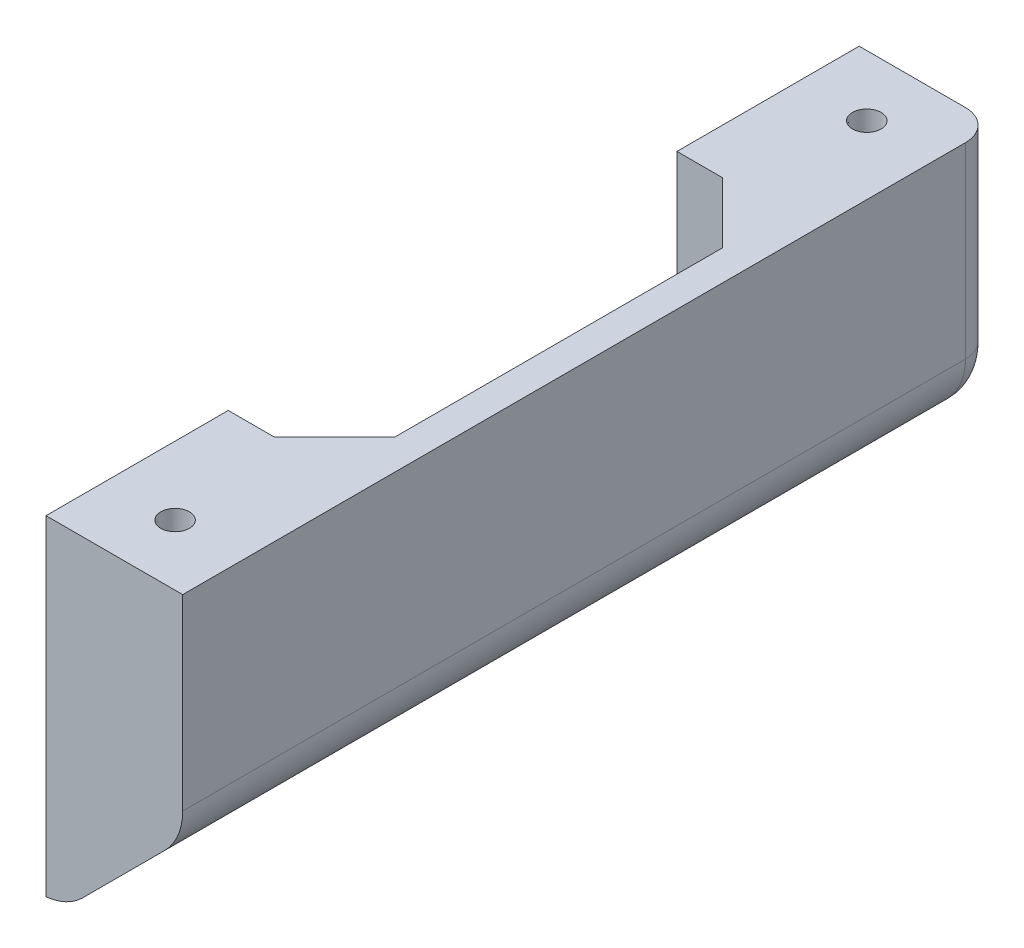
ISO-10303-21;
HEADER;
FILE_DESCRIPTION(('STEP AP214'),'2;1');
FILE_NAME('part.step','',(''),(''),'','','');
FILE_SCHEMA(('AUTOMOTIVE_DESIGN { 1 0 10303 214 1 1 1 1 }'));
ENDSEC;
DATA;
#1=APPLICATION_CONTEXT('core data for automotive mechanical design processes');
#2=APPLICATION_PROTOCOL_DEFINITION('international standard','automotive_design',2000,#1);
#3=PRODUCT_CONTEXT('',#1,'mechanical');
#4=PRODUCT('Part','Part','',(#3));
#5=PRODUCT_RELATED_PRODUCT_CATEGORY('part','',(#4));
#6=PRODUCT_DEFINITION_FORMATION('','',#4);
#7=PRODUCT_DEFINITION_CONTEXT('part definition',#1,'design');
#8=PRODUCT_DEFINITION('design','',#6,#7);
#9=PRODUCT_DEFINITION_SHAPE('','',#8);
#10=(LENGTH_UNIT() NAMED_UNIT(*) SI_UNIT(.MILLI.,.METRE.));
#11=(NAMED_UNIT(*) PLANE_ANGLE_UNIT() SI_UNIT($,.RADIAN.));
#12=(NAMED_UNIT(*) SI_UNIT($,.STERADIAN.) SOLID_ANGLE_UNIT());
#13=UNCERTAINTY_MEASURE_WITH_UNIT(LENGTH_MEASURE(1.E-05),#10,'distance_accuracy_value','');
#14=(GEOMETRIC_REPRESENTATION_CONTEXT(3) GLOBAL_UNCERTAINTY_ASSIGNED_CONTEXT((#13)) GLOBAL_UNIT_ASSIGNED_CONTEXT((#10,
#11,#12)) REPRESENTATION_CONTEXT('',''));
#15=CARTESIAN_POINT('',(0.,0.,0.));
#16=DIRECTION('',(0.,0.,1.));
#17=DIRECTION('',(1.,0.,0.));
#18=AXIS2_PLACEMENT_3D('',#15,#16,#17);
#19=CARTESIAN_POINT('',(-231.304465963193,69.0000000000106,-244.682867011126));
#20=DIRECTION('',(0.,-1.00000000000003,0.));
#21=DIRECTION('',(0.,0.,1.00000000000003));
#22=AXIS2_PLACEMENT_3D('',#19,#20,#21);
#23=PLANE('',#22);
#24=CARTESIAN_POINT('',(-217.016965963193,69.0000000000068,-12.700000000001));
#25=DIRECTION('',(0.,-1.00000000000003,0.));
#26=DIRECTION('',(0.,0.,-1.00000000000003));
#27=AXIS2_PLACEMENT_3D('',#24,#25,#26);
#28=CIRCLE('',#27,2.99720000000001);
#29=CARTESIAN_POINT('',(-217.016965963193,69.0000000000068,-15.6972000000011));
#30=VERTEX_POINT('',#29);
#31=EDGE_CURVE('E204',#30,#30,#28,.T.);
#32=ORIENTED_EDGE('',*,*,#31,.T.);
#33=EDGE_LOOP('',(#32));
#34=FACE_BOUND('',#33,.T.);
#35=CARTESIAN_POINT('',(-217.016965963193,69.0000000000091,-157.300000000006));
#36=DIRECTION('',(0.,-1.00000000000003,0.));
#37=DIRECTION('',(0.,0.,-1.00000000000003));
#38=AXIS2_PLACEMENT_3D('',#35,#36,#37);
#39=CIRCLE('',#38,2.99720000000001);
#40=CARTESIAN_POINT('',(-217.016965963193,69.0000000000092,-160.297200000006));
#41=VERTEX_POINT('',#40);
#42=EDGE_CURVE('E210',#41,#41,#39,.T.);
#43=ORIENTED_EDGE('',*,*,#42,.T.);
#44=EDGE_LOOP('',(#43));
#45=FACE_BOUND('',#44,.T.);
#46=DIRECTION('',(0.,0.,1.00000000000003));
#47=VECTOR('',#46,1.);
#48=CARTESIAN_POINT('',(-209.079465963193,69.0000000000119,-244.682867011126));
#49=LINE('',#48,#47);
#50=CARTESIAN_POINT('',(-209.079465963193,69.0000000000098,-119.200000000005));
#51=VERTEX_POINT('',#50);
#52=CARTESIAN_POINT('',(-209.079465963193,69.0000000000086,-50.8000000000031));
#53=VERTEX_POINT('',#52);
#54=EDGE_CURVE('E238',#51,#53,#49,.T.);
#55=ORIENTED_EDGE('',*,*,#54,.T.);
#56=DIRECTION('',(-0.707106781186556,0.,0.707106781186573));
#57=VECTOR('',#56,1.);
#58=CARTESIAN_POINT('',(-123.250532457636,69.0000000000074,-136.628933505565));
#59=LINE('',#58,#57);
#60=CARTESIAN_POINT('',(-221.779465963193,69.0000000000079,-38.1000000000018));
#61=VERTEX_POINT('',#60);
#62=EDGE_CURVE('E11',#61,#53,#59,.F.);
#63=ORIENTED_EDGE('',*,*,#62,.F.);
#64=DIRECTION('',(-1.,0.,0.));
#65=VECTOR('',#64,1.);
#66=CARTESIAN_POINT('',(-202.727465963193,69.0000000000051,-38.1000000000016));
#67=LINE('',#66,#65);
#68=CARTESIAN_POINT('',(-231.304465963193,69.000000000008,-38.1000000000019));
#69=VERTEX_POINT('',#68);
#70=EDGE_CURVE('E222',#61,#69,#67,.T.);
#71=ORIENTED_EDGE('',*,*,#70,.T.);
#72=DIRECTION('',(0.,0.,1.00000000000003));
#73=VECTOR('',#72,1.);
#74=CARTESIAN_POINT('',(-231.304465963193,69.0000000000106,-244.682867011126));
#75=LINE('',#74,#73);
#76=CARTESIAN_POINT('',(-231.304465963193,69.0000000000077,-9.15933995315754E-13));
#77=VERTEX_POINT('',#76);
#78=EDGE_CURVE('E256',#69,#77,#75,.T.);
#79=ORIENTED_EDGE('',*,*,#78,.T.);
#80=DIRECTION('',(-1.,0.,0.));
#81=VECTOR('',#80,1.);
#82=CARTESIAN_POINT('',(-231.304465963193,69.0000000000077,-9.15933995315754E-13));
#83=LINE('',#82,#81);
#84=CARTESIAN_POINT('',(-202.729465963193,69.0000000000044,-4.44089209850063E-13));
#85=VERTEX_POINT('',#84);
#86=EDGE_CURVE('E253',#85,#77,#83,.T.);
#87=ORIENTED_EDGE('',*,*,#86,.F.);
#88=DIRECTION('',(0.,0.,1.00000000000003));
#89=VECTOR('',#88,1.);
#90=CARTESIAN_POINT('',(-202.729465963193,69.0000000000086,-244.682867011126));
#91=LINE('',#90,#89);
#92=CARTESIAN_POINT('',(-202.729465963193,69.0000000000079,-163.650000000006));
#93=VERTEX_POINT('',#92);
#94=EDGE_CURVE('E235',#93,#85,#91,.T.);
#95=ORIENTED_EDGE('',*,*,#94,.F.);
#96=CARTESIAN_POINT('',(-209.079465963193,69.0000000000106,-163.650000000006));
#97=DIRECTION('',(0.,1.00000000000003,0.));
#98=DIRECTION('',(0.,0.,1.00000000000003));
#99=AXIS2_PLACEMENT_3D('',#96,#97,#98);
#100=CIRCLE('',#99,6.35);
#101=CARTESIAN_POINT('',(-209.079465963193,69.0000000000106,-170.000000000007));
#102=VERTEX_POINT('',#101);
#103=EDGE_CURVE('E292',#102,#93,#100,.F.);
#104=ORIENTED_EDGE('',*,*,#103,.F.);
#105=DIRECTION('',(-1.,0.,0.));
#106=VECTOR('',#105,1.);
#107=CARTESIAN_POINT('',(-231.304465963193,69.0000000000096,-170.000000000007));
#108=LINE('',#107,#106);
#109=CARTESIAN_POINT('',(-231.304465963193,69.0000000000096,-170.000000000007));
#110=VERTEX_POINT('',#109);
#111=EDGE_CURVE('E244',#102,#110,#108,.T.);
#112=ORIENTED_EDGE('',*,*,#111,.T.);
#113=CARTESIAN_POINT('',(-231.304465963193,69.0000000000092,-131.900000000005));
#114=VERTEX_POINT('',#113);
#115=EDGE_CURVE('E252',#110,#114,#75,.T.);
#116=ORIENTED_EDGE('',*,*,#115,.T.);
#117=DIRECTION('',(-1.,0.,0.));
#118=VECTOR('',#117,1.);
#119=CARTESIAN_POINT('',(-202.727465963193,69.0000000000073,-131.900000000005));
#120=LINE('',#119,#118);
#121=CARTESIAN_POINT('',(-221.779465963193,69.0000000000089,-131.900000000005));
#122=VERTEX_POINT('',#121);
#123=EDGE_CURVE('E219',#122,#114,#120,.T.);
#124=ORIENTED_EDGE('',*,*,#123,.F.);
#125=DIRECTION('',(0.707106781186532,0.,0.707106781186574));
#126=VECTOR('',#125,1.);
#127=CARTESIAN_POINT('',(-282.933399468757,69.0000000000099,-193.053933505566));
#128=LINE('',#127,#126);
#129=EDGE_CURVE('E426',#51,#122,#128,.F.);
#130=ORIENTED_EDGE('',*,*,#129,.F.);
#131=EDGE_LOOP('',(#55,#63,#71,#79,#87,#95,#104,#112,#116,#124,#130));
#132=FACE_BOUND('',#131,.T.);
#133=ADVANCED_FACE('F37',(#34,#45,#132),#23,.F.);
#134=CARTESIAN_POINT('',(-231.304465963193,5.93969318174459E-12,-244.682867011125));
#135=DIRECTION('',(1.,0.,0.));
#136=DIRECTION('',(0.,0.,1.00000000000003));
#137=AXIS2_PLACEMENT_3D('',#134,#135,#136);
#138=PLANE('',#137);
#139=CARTESIAN_POINT('',(-231.304465963193,34.5000000000071,-141.425000000005));
#140=DIRECTION('',(1.,0.,0.));
#141=DIRECTION('',(0.,0.,-1.00000000000003));
#142=AXIS2_PLACEMENT_3D('',#139,#140,#141);
#143=CIRCLE('',#142,2.99720000000001);
#144=CARTESIAN_POINT('',(-231.304465963193,34.5000000000071,-144.422200000005));
#145=VERTEX_POINT('',#144);
#146=EDGE_CURVE('E184',#145,#145,#143,.T.);
#147=ORIENTED_EDGE('',*,*,#146,.T.);
#148=EDGE_LOOP('',(#147));
#149=FACE_BOUND('',#148,.T.);
#150=CARTESIAN_POINT('',(-231.304465963193,34.5000000000057,-19.0500000000011));
#151=DIRECTION('',(1.,0.,0.));
#152=DIRECTION('',(0.,0.,-1.00000000000003));
#153=AXIS2_PLACEMENT_3D('',#150,#151,#152);
#154=CIRCLE('',#153,2.99720000000001);
#155=CARTESIAN_POINT('',(-231.304465963193,34.5000000000057,-22.0472000000012));
#156=VERTEX_POINT('',#155);
#157=EDGE_CURVE('E190',#156,#156,#154,.T.);
#158=ORIENTED_EDGE('',*,*,#157,.T.);
#159=EDGE_LOOP('',(#158));
#160=FACE_BOUND('',#159,.T.);
#161=DIRECTION('',(0.,-1.00000000000003,0.));
#162=VECTOR('',#161,1.);
#163=CARTESIAN_POINT('',(-231.304465963193,69.0000000000092,-131.900000000005));
#164=LINE('',#163,#162);
#165=CARTESIAN_POINT('',(-231.30446596319,22.9157683632159,-131.900000000005));
#166=VERTEX_POINT('',#165);
#167=EDGE_CURVE('E216',#114,#166,#164,.T.);
#168=ORIENTED_EDGE('',*,*,#167,.F.);
#169=ORIENTED_EDGE('',*,*,#115,.F.);
#170=DIRECTION('',(0.,-1.00000000000003,0.));
#171=VECTOR('',#170,1.);
#172=CARTESIAN_POINT('',(-231.304465963193,4.21884749357559E-12,-170.000000000006));
#173=LINE('',#172,#171);
#174=CARTESIAN_POINT('',(-231.304465963193,6.41804812750946,-170.000000000006));
#175=VERTEX_POINT('',#174);
#176=EDGE_CURVE('E257',#110,#175,#173,.T.);
#177=ORIENTED_EDGE('',*,*,#176,.T.);
#178=CARTESIAN_POINT('',(-231.304465963193,3.83026943495679E-12,-163.650000000005));
#179=CARTESIAN_POINT('',(-231.304465963193,-1.94645687613547E-05,-163.827803696936));
#180=CARTESIAN_POINT('',(-231.304465963193,0.00750667466375468,-164.005604471068));
#181=CARTESIAN_POINT('',(-231.304465963193,0.0375094933302196,-164.359930980728));
#182=CARTESIAN_POINT('',(-231.304465963193,0.0599853722506052,-164.536456784015));
#183=CARTESIAN_POINT('',(-231.304465963193,0.119721245660342,-164.88683222851));
#184=CARTESIAN_POINT('',(-231.304465963193,0.156968465720615,-165.060684047614));
#185=CARTESIAN_POINT('',(-231.304465963193,0.245971625268004,-165.404630889584));
#186=CARTESIAN_POINT('',(-231.304465963193,0.297727401623886,-165.574725954666));
#187=CARTESIAN_POINT('',(-231.304465963193,0.415391932519223,-165.91000029629));
#188=CARTESIAN_POINT('',(-231.304465963193,0.481304540643922,-166.075178220386));
#189=CARTESIAN_POINT('',(-231.304465963193,0.626825096149477,-166.399459779303));
#190=CARTESIAN_POINT('',(-231.304465963193,0.706438076862064,-166.558561155339));
#191=CARTESIAN_POINT('',(-231.304465963193,0.878739451237914,-166.869448719973));
#192=CARTESIAN_POINT('',(-231.304465963193,0.971423457833145,-167.021237340134));
#193=CARTESIAN_POINT('',(-231.304465963193,1.16922184311304,-167.316491773836));
#194=CARTESIAN_POINT('',(-231.304465963193,1.27433652145266,-167.459957386617));
#195=CARTESIAN_POINT('',(-231.304465963193,1.49639703834618,-167.737755205205));
#196=CARTESIAN_POINT('',(-231.304465963193,1.61335952649071,-167.872074101574));
#197=CARTESIAN_POINT('',(-231.304465963193,1.85814907794117,-168.130416736264));
#198=CARTESIAN_POINT('',(-231.304465963193,1.9859761587785,-168.254440457971));
#199=CARTESIAN_POINT('',(-231.304465963193,2.25159440057136,-168.491349975786));
#200=CARTESIAN_POINT('',(-231.304465963193,2.38938684413101,-168.604234333751));
#201=CARTESIAN_POINT('',(-231.304465963193,2.67393253723037,-168.818073507178));
#202=CARTESIAN_POINT('',(-231.304465963193,2.82068567266183,-168.919028474504));
#203=CARTESIAN_POINT('',(-231.304465963193,3.12285855334713,-169.108802472058));
#204=CARTESIAN_POINT('',(-231.304465963193,3.27831774550247,-169.197558695214));
#205=CARTESIAN_POINT('',(-231.304465963193,3.59606019388042,-169.361721397576));
#206=CARTESIAN_POINT('',(-231.304465963193,3.75834108405891,-169.437132458915));
#207=CARTESIAN_POINT('',(-231.304465963193,4.08862458888874,-169.574158612));
#208=CARTESIAN_POINT('',(-231.304465963193,4.25662696478117,-169.635774278619));
#209=CARTESIAN_POINT('',(-231.304465963193,4.59710267553243,-169.74482959152));
#210=CARTESIAN_POINT('',(-231.304465963193,4.76957507653026,-169.792272173255));
#211=CARTESIAN_POINT('',(-231.304465963193,5.18540606109357,-169.888337439605));
#212=CARTESIAN_POINT('',(-231.304465963193,5.43035077199738,-169.930302426444));
#213=CARTESIAN_POINT('',(-231.304465963193,5.79978470030706,-169.972170078544));
#214=CARTESIAN_POINT('',(-231.304465963193,5.92318413235425,-169.982612703535));
#215=CARTESIAN_POINT('',(-231.304465963193,6.1703947621389,-169.996527939177));
#216=CARTESIAN_POINT('',(-231.304465963193,6.29420601995963,-169.999999483698));
#217=CARTESIAN_POINT('',(-231.304465963193,6.41804812750985,-170.000000000006));
#218=B_SPLINE_CURVE_WITH_KNOTS('',3,(#178,#179,#180,#181,#182,#183,#184,#185,#186,#187,#188,
#189,#190,#191,#192,#193,#194,#195,#196,#197,#198,#199,#200,#201,#202,#203,#204,#205,#206,#207,
#208,#209,#210,#211,#212,#213,#214,#215,#216,#217),.UNSPECIFIED.,.F.,.F.,(4,2,2,2,2,2,2,2,2,2,2,
2,2,2,2,2,2,2,2,4),(0.,0.533247724383949,1.06646689725572,1.59922593802575,2.13197898880257,
2.66487724276769,3.19797169595554,3.7308876489854,4.2638164511572,4.79750484490049,
5.33119409983355,5.8649521665535,6.39870343764898,6.93510736260551,7.47132675148192,
8.00752379115188,8.54360969942229,9.28729610396884,9.65865392644396,10.0300685386423),.UNSPECIFIED.);
#219=CARTESIAN_POINT('',(-231.304465963193,3.83026943495679E-12,-163.650000000005));
#220=VERTEX_POINT('',#219);
#221=EDGE_CURVE('E306',#220,#175,#218,.T.);
#222=ORIENTED_EDGE('',*,*,#221,.F.);
#223=DIRECTION('',(0.,0.,1.00000000000003));
#224=VECTOR('',#223,1.);
#225=CARTESIAN_POINT('',(-231.304465963193,5.93969318174459E-12,-244.682867011125));
#226=LINE('',#225,#224);
#227=CARTESIAN_POINT('',(-231.304465963193,1.11022302462516E-13,2.77555756156289E-13));
#228=VERTEX_POINT('',#227);
#229=EDGE_CURVE('E248',#220,#228,#226,.T.);
#230=ORIENTED_EDGE('',*,*,#229,.T.);
#231=DIRECTION('',(0.,-1.00000000000003,0.));
#232=VECTOR('',#231,1.);
#233=CARTESIAN_POINT('',(-231.304465963193,1.11022302462516E-13,2.77555756156289E-13));
#234=LINE('',#233,#232);
#235=EDGE_CURVE('E249',#77,#228,#234,.T.);
#236=ORIENTED_EDGE('',*,*,#235,.F.);
#237=ORIENTED_EDGE('',*,*,#78,.F.);
#238=DIRECTION('',(0.,1.00000000000003,0.));
#239=VECTOR('',#238,1.);
#240=CARTESIAN_POINT('',(-231.304465963193,69.000000000008,-38.1000000000019));
#241=LINE('',#240,#239);
#242=CARTESIAN_POINT('',(-231.304465963193,22.9157683632144,-38.1000000000008));
#243=VERTEX_POINT('',#242);
#244=EDGE_CURVE('E223',#243,#69,#241,.T.);
#245=ORIENTED_EDGE('',*,*,#244,.F.);
#246=DIRECTION('',(0.,-0.816496580927745,-0.577350269189631));
#247=VECTOR('',#246,1.);
#248=CARTESIAN_POINT('',(-231.304465963193,-89.7455079726098,-117.763552474192));
#249=LINE('',#248,#247);
#250=CARTESIAN_POINT('',(-231.304465963193,6.35000000000335,-49.8137671451923));
#251=VERTEX_POINT('',#250);
#252=EDGE_CURVE('E46',#251,#243,#249,.F.);
#253=ORIENTED_EDGE('',*,*,#252,.F.);
#254=DIRECTION('',(0.,0.,1.00000000000003));
#255=VECTOR('',#254,1.);
#256=CARTESIAN_POINT('',(-231.304465963193,6.3500000000058,-244.682867011125));
#257=LINE('',#256,#255);
#258=CARTESIAN_POINT('',(-231.304465963193,6.35000000000313,-120.186232854814));
#259=VERTEX_POINT('',#258);
#260=EDGE_CURVE('E232',#259,#251,#257,.T.);
#261=ORIENTED_EDGE('',*,*,#260,.F.);
#262=DIRECTION('',(0.,0.816496580927757,-0.577350269189659));
#263=VECTOR('',#262,1.);
#264=CARTESIAN_POINT('',(-231.304465963193,60.8049428312248,-158.691692199896));
#265=LINE('',#264,#263);
#266=EDGE_CURVE('E423',#166,#259,#265,.F.);
#267=ORIENTED_EDGE('',*,*,#266,.F.);
#268=EDGE_LOOP('',(#168,#169,#177,#222,#230,#236,#237,#245,#253,#261,#267));
#269=FACE_BOUND('',#268,.T.);
#270=ADVANCED_FACE('F317',(#149,#160,#269),#138,.F.);
#271=CARTESIAN_POINT('',(-202.729465963193,24.55000000001,-244.682867011125));
#272=DIRECTION('',(-0.707106781186537,0.707106781186568,0.));
#273=DIRECTION('',(-0.707106781186558,-0.707106781186577,0.));
#274=AXIS2_PLACEMENT_3D('',#271,#272,#273);
#275=PLANE('',#274);
#276=DIRECTION('',(0.,0.,1.00000000000003));
#277=VECTOR('',#276,1.);
#278=CARTESIAN_POINT('',(-206.449209842124,20.8302561210795,-244.682867011125));
#279=LINE('',#278,#277);
#280=CARTESIAN_POINT('',(-206.449209842124,20.8302561210761,-2.22044604925031E-13));
#281=VERTEX_POINT('',#280);
#282=CARTESIAN_POINT('',(-206.449209842123,20.8302561210787,-163.650000000005));
#283=VERTEX_POINT('',#282);
#284=EDGE_CURVE('E278',#281,#283,#279,.F.);
#285=ORIENTED_EDGE('',*,*,#284,.F.);
#286=DIRECTION('',(0.707106781186558,0.707106781186577,0.));
#287=VECTOR('',#286,1.);
#288=CARTESIAN_POINT('',(-202.729465963193,24.5500000000037,-1.11022302462516E-13));
#289=LINE('',#288,#287);
#290=CARTESIAN_POINT('',(-223.626687979078,3.65277798412117,-4.44089209850063E-13));
#291=VERTEX_POINT('',#290);
#292=EDGE_CURVE('E245',#291,#281,#289,.T.);
#293=ORIENTED_EDGE('',*,*,#292,.F.);
#294=DIRECTION('',(0.,0.,1.00000000000003));
#295=VECTOR('',#294,1.);
#296=CARTESIAN_POINT('',(-223.626687979079,3.65277798412184,-244.682867011125));
#297=LINE('',#296,#295);
#298=CARTESIAN_POINT('',(-223.626687979078,3.65277798412206,-163.650000000005));
#299=VERTEX_POINT('',#298);
#300=EDGE_CURVE('E275',#299,#291,#297,.T.);
#301=ORIENTED_EDGE('',*,*,#300,.F.);
#302=DIRECTION('',(0.707106781186558,0.707106781186577,0.));
#303=VECTOR('',#302,1.);
#304=CARTESIAN_POINT('',(-223.626687979078,3.65277798412161,-163.650000000005));
#305=LINE('',#304,#303);
#306=EDGE_CURVE('E301',#283,#299,#305,.F.);
#307=ORIENTED_EDGE('',*,*,#306,.F.);
#308=EDGE_LOOP('',(#285,#293,#301,#307));
#309=FACE_BOUND('',#308,.T.);
#310=ADVANCED_FACE('F347',(#309),#275,.F.);
#311=CARTESIAN_POINT('',(-202.729465963193,69.0000000000086,-244.682867011126));
#312=DIRECTION('',(-1.,0.,0.));
#313=DIRECTION('',(0.,-1.00000000000003,0.));
#314=AXIS2_PLACEMENT_3D('',#311,#312,#313);
#315=PLANE('',#314);
#316=ORIENTED_EDGE('',*,*,#94,.T.);
#317=DIRECTION('',(0.,1.00000000000003,0.));
#318=VECTOR('',#317,1.);
#319=CARTESIAN_POINT('',(-202.729465963193,69.0000000000044,-4.44089209850063E-13));
#320=LINE('',#319,#318);
#321=CARTESIAN_POINT('',(-202.729465963193,29.8105122421415,-1.66533453693773E-13));
#322=VERTEX_POINT('',#321);
#323=EDGE_CURVE('E242',#322,#85,#320,.T.);
#324=ORIENTED_EDGE('',*,*,#323,.F.);
#325=DIRECTION('',(0.,0.,1.00000000000003));
#326=VECTOR('',#325,1.);
#327=CARTESIAN_POINT('',(-202.729465963198,29.8105122421483,-244.682867011125));
#328=LINE('',#327,#326);
#329=CARTESIAN_POINT('',(-202.729465963193,29.8105122421444,-163.650000000006));
#330=VERTEX_POINT('',#329);
#331=EDGE_CURVE('E260',#330,#322,#328,.T.);
#332=ORIENTED_EDGE('',*,*,#331,.F.);
#333=DIRECTION('',(0.,1.00000000000003,0.));
#334=VECTOR('',#333,1.);
#335=CARTESIAN_POINT('',(-202.729465963193,29.8105122421444,-163.650000000006));
#336=LINE('',#335,#334);
#337=EDGE_CURVE('E295',#93,#330,#336,.F.);
#338=ORIENTED_EDGE('',*,*,#337,.F.);
#339=EDGE_LOOP('',(#316,#324,#332,#338));
#340=FACE_BOUND('',#339,.T.);
#341=ADVANCED_FACE('F458',(#340),#315,.F.);
#342=CARTESIAN_POINT('',(0.,0.,0.));
#343=DIRECTION('',(0.,0.,1.00000000000003));
#344=DIRECTION('',(-1.,0.,0.));
#345=AXIS2_PLACEMENT_3D('',#342,#343,#344);
#346=PLANE('',#345);
#347=ORIENTED_EDGE('',*,*,#323,.T.);
#348=ORIENTED_EDGE('',*,*,#86,.T.);
#349=ORIENTED_EDGE('',*,*,#235,.T.);
#350=CARTESIAN_POINT('',(-232.606944100148,12.6330341051892,-2.77555756156289E-13));
#351=DIRECTION('',(0.,0.,-1.00000000000003));
#352=DIRECTION('',(-1.,0.,0.));
#353=AXIS2_PLACEMENT_3D('',#350,#351,#352);
#354=CIRCLE('',#353,12.7);
#355=EDGE_CURVE('E271',#291,#228,#354,.T.);
#356=ORIENTED_EDGE('',*,*,#355,.F.);
#357=ORIENTED_EDGE('',*,*,#292,.T.);
#358=CARTESIAN_POINT('',(-215.429465963193,29.810512242144,-3.05311331771918E-13));
#359=DIRECTION('',(0.,0.,-1.00000000000003));
#360=DIRECTION('',(-1.,0.,0.));
#361=AXIS2_PLACEMENT_3D('',#358,#359,#360);
#362=CIRCLE('',#361,12.7);
#363=EDGE_CURVE('E273',#322,#281,#362,.T.);
#364=ORIENTED_EDGE('',*,*,#363,.F.);
#365=EDGE_LOOP('',(#347,#348,#349,#356,#357,#364));
#366=FACE_BOUND('',#365,.T.);
#367=ADVANCED_FACE('F355',(#366),#346,.T.);
#368=CARTESIAN_POINT('',(-5.82867087928207E-13,3.99680288865056E-12,-170.000000000006));
#369=DIRECTION('',(0.,0.,-1.00000000000003));
#370=DIRECTION('',(1.,0.,0.));
#371=AXIS2_PLACEMENT_3D('',#368,#369,#370);
#372=PLANE('',#371);
#373=CARTESIAN_POINT('',(-215.429465963196,29.8105122421469,-170.000000000006));
#374=DIRECTION('',(0.,0.,1.00000000000003));
#375=DIRECTION('',(1.,0.,0.));
#376=AXIS2_PLACEMENT_3D('',#373,#374,#375);
#377=CIRCLE('',#376,6.35);
#378=CARTESIAN_POINT('',(-210.939337902659,25.3203841816102,-170.000000000006));
#379=VERTEX_POINT('',#378);
#380=CARTESIAN_POINT('',(-209.079465963196,29.8105122421474,-170.000000000006));
#381=VERTEX_POINT('',#380);
#382=EDGE_CURVE('E287',#379,#381,#377,.T.);
#383=ORIENTED_EDGE('',*,*,#382,.F.);
#384=DIRECTION('',(0.707106781186558,0.707106781186577,0.));
#385=VECTOR('',#384,1.);
#386=CARTESIAN_POINT('',(-210.939337902659,25.3203841816102,-170.000000000006));
#387=LINE('',#386,#385);
#388=CARTESIAN_POINT('',(-228.116816039613,8.1429060446554,-170.000000000006));
#389=VERTEX_POINT('',#388);
#390=EDGE_CURVE('E284',#389,#379,#387,.T.);
#391=ORIENTED_EDGE('',*,*,#390,.F.);
#392=CARTESIAN_POINT('',(-232.606944100148,12.6330341051904,-170.000000000006));
#393=DIRECTION('',(0.,0.,1.00000000000003));
#394=DIRECTION('',(1.,0.,0.));
#395=AXIS2_PLACEMENT_3D('',#392,#393,#394);
#396=CIRCLE('',#395,6.35);
#397=EDGE_CURVE('E281',#175,#389,#396,.T.);
#398=ORIENTED_EDGE('',*,*,#397,.F.);
#399=ORIENTED_EDGE('',*,*,#176,.F.);
#400=ORIENTED_EDGE('',*,*,#111,.F.);
#401=DIRECTION('',(0.,1.00000000000003,0.));
#402=VECTOR('',#401,1.);
#403=CARTESIAN_POINT('',(-209.079465963193,69.0000000000106,-170.000000000007));
#404=LINE('',#403,#402);
#405=EDGE_CURVE('E290',#381,#102,#404,.T.);
#406=ORIENTED_EDGE('',*,*,#405,.F.);
#407=EDGE_LOOP('',(#383,#391,#398,#399,#400,#406));
#408=FACE_BOUND('',#407,.T.);
#409=ADVANCED_FACE('F351',(#408),#372,.T.);
#410=CARTESIAN_POINT('',(-227.279465963194,6.35000000000591,-244.682867011125));
#411=DIRECTION('',(0.,1.00000000000003,0.));
#412=DIRECTION('',(-1.,0.,0.));
#413=AXIS2_PLACEMENT_3D('',#410,#411,#412);
#414=PLANE('',#413);
#415=ORIENTED_EDGE('',*,*,#260,.T.);
#416=DIRECTION('',(0.816496580927736,0.,-0.577350269189642));
#417=VECTOR('',#416,1.);
#418=CARTESIAN_POINT('',(-136.758957990583,6.35000000000513,-116.667536963354));
#419=LINE('',#418,#417);
#420=CARTESIAN_POINT('',(-229.909722084263,6.35000000000208,-50.8000000000012));
#421=VERTEX_POINT('',#420);
#422=EDGE_CURVE('E411',#421,#251,#419,.F.);
#423=ORIENTED_EDGE('',*,*,#422,.F.);
#424=DIRECTION('',(0.,0.,1.00000000000003));
#425=VECTOR('',#424,1.);
#426=CARTESIAN_POINT('',(-229.909722084263,6.3500000000058,-244.682867011125));
#427=LINE('',#426,#425);
#428=CARTESIAN_POINT('',(-229.909722084263,6.3500000000058,-119.200000000004));
#429=VERTEX_POINT('',#428);
#430=EDGE_CURVE('E228',#429,#421,#427,.T.);
#431=ORIENTED_EDGE('',*,*,#430,.F.);
#432=DIRECTION('',(-0.816496580927712,0.,-0.577350269189646));
#433=VECTOR('',#432,1.);
#434=CARTESIAN_POINT('',(-287.309408794408,6.35000000000141,-159.787707710735));
#435=LINE('',#434,#433);
#436=EDGE_CURVE('E413',#259,#429,#435,.F.);
#437=ORIENTED_EDGE('',*,*,#436,.F.);
#438=EDGE_LOOP('',(#415,#423,#431,#437));
#439=FACE_BOUND('',#438,.T.);
#440=ADVANCED_FACE('F354',(#439),#414,.T.);
#441=CARTESIAN_POINT('',(-207.219594023733,29.0401280605442,-244.682867011125));
#442=DIRECTION('',(-0.707106781186537,0.707106781186568,0.));
#443=DIRECTION('',(-0.707106781186558,-0.707106781186577,0.));
#444=AXIS2_PLACEMENT_3D('',#441,#442,#443);
#445=PLANE('',#444);
#446=ORIENTED_EDGE('',*,*,#430,.T.);
#447=DIRECTION('',(-0.707106781186558,-0.707106781186577,0.));
#448=VECTOR('',#447,1.);
#449=CARTESIAN_POINT('',(-229.909722084263,6.35000000000496,-50.8000000000014));
#450=LINE('',#449,#448);
#451=CARTESIAN_POINT('',(-209.079465963193,27.1802561210758,-50.8000000000011));
#452=VERTEX_POINT('',#451);
#453=EDGE_CURVE('E315',#452,#421,#450,.T.);
#454=ORIENTED_EDGE('',*,*,#453,.F.);
#455=DIRECTION('',(0.,0.,1.00000000000003));
#456=VECTOR('',#455,1.);
#457=CARTESIAN_POINT('',(-209.079465963193,27.1802561210795,-244.682867011125));
#458=LINE('',#457,#456);
#459=CARTESIAN_POINT('',(-209.079465963193,27.1802561210767,-119.200000000004));
#460=VERTEX_POINT('',#459);
#461=EDGE_CURVE('E231',#460,#452,#458,.T.);
#462=ORIENTED_EDGE('',*,*,#461,.F.);
#463=DIRECTION('',(0.707106781186558,0.707106781186577,0.));
#464=VECTOR('',#463,1.);
#465=CARTESIAN_POINT('',(-209.079465963193,27.1802561210767,-119.200000000004));
#466=LINE('',#465,#464);
#467=EDGE_CURVE('E403',#429,#460,#466,.T.);
#468=ORIENTED_EDGE('',*,*,#467,.F.);
#469=EDGE_LOOP('',(#446,#454,#462,#468));
#470=FACE_BOUND('',#469,.T.);
#471=ADVANCED_FACE('F446',(#470),#445,.T.);
#472=CARTESIAN_POINT('',(-209.079465963193,69.0000000000119,-244.682867011126));
#473=DIRECTION('',(-1.,0.,0.));
#474=DIRECTION('',(0.,-1.00000000000003,0.));
#475=AXIS2_PLACEMENT_3D('',#472,#473,#474);
#476=PLANE('',#475);
#477=ORIENTED_EDGE('',*,*,#461,.T.);
#478=DIRECTION('',(0.,-1.00000000000003,0.));
#479=VECTOR('',#478,1.);
#480=CARTESIAN_POINT('',(-209.079465963193,27.1802561210759,-50.8000000000014));
#481=LINE('',#480,#479);
#482=EDGE_CURVE('E416',#53,#452,#481,.T.);
#483=ORIENTED_EDGE('',*,*,#482,.F.);
#484=ORIENTED_EDGE('',*,*,#54,.F.);
#485=DIRECTION('',(0.,1.00000000000003,0.));
#486=VECTOR('',#485,1.);
#487=CARTESIAN_POINT('',(-209.079465963193,69.0000000000098,-119.200000000005));
#488=LINE('',#487,#486);
#489=EDGE_CURVE('E418',#460,#51,#488,.T.);
#490=ORIENTED_EDGE('',*,*,#489,.F.);
#491=EDGE_LOOP('',(#477,#483,#484,#490));
#492=FACE_BOUND('',#491,.T.);
#493=ADVANCED_FACE('F360',(#492),#476,.T.);
#494=CARTESIAN_POINT('',(-215.429465963198,29.8105122421478,-244.682867011125));
#495=DIRECTION('',(0.,0.,1.00000000000003));
#496=DIRECTION('',(-1.,0.,0.));
#497=AXIS2_PLACEMENT_3D('',#494,#495,#496);
#498=CYLINDRICAL_SURFACE('',#497,12.7);
#499=ORIENTED_EDGE('',*,*,#331,.T.);
#500=ORIENTED_EDGE('',*,*,#363,.T.);
#501=ORIENTED_EDGE('',*,*,#284,.T.);
#502=CARTESIAN_POINT('',(-215.429465963193,29.8105122421462,-163.650000000006));
#503=DIRECTION('',(0.,0.,1.00000000000003));
#504=DIRECTION('',(1.,0.,0.));
#505=AXIS2_PLACEMENT_3D('',#502,#503,#504);
#506=CIRCLE('',#505,12.7);
#507=EDGE_CURVE('E298',#330,#283,#506,.F.);
#508=ORIENTED_EDGE('',*,*,#507,.F.);
#509=EDGE_LOOP('',(#499,#500,#501,#508));
#510=FACE_BOUND('',#509,.T.);
#511=ADVANCED_FACE('F357',(#510),#498,.T.);
#512=CARTESIAN_POINT('',(-232.606944100148,12.6330341051896,-244.682867011125));
#513=DIRECTION('',(0.,0.,1.00000000000003));
#514=DIRECTION('',(-1.,0.,0.));
#515=AXIS2_PLACEMENT_3D('',#512,#513,#514);
#516=CYLINDRICAL_SURFACE('',#515,12.7);
#517=ORIENTED_EDGE('',*,*,#300,.T.);
#518=ORIENTED_EDGE('',*,*,#355,.T.);
#519=ORIENTED_EDGE('',*,*,#229,.F.);
#520=CARTESIAN_POINT('',(-232.606944100148,12.6330341051889,-163.650000000005));
#521=DIRECTION('',(0.,0.,1.00000000000003));
#522=DIRECTION('',(1.,0.,0.));
#523=AXIS2_PLACEMENT_3D('',#520,#521,#522);
#524=CIRCLE('',#523,12.7);
#525=EDGE_CURVE('E304',#299,#220,#524,.F.);
#526=ORIENTED_EDGE('',*,*,#525,.F.);
#527=EDGE_LOOP('',(#517,#518,#519,#526));
#528=FACE_BOUND('',#527,.T.);
#529=ADVANCED_FACE('F327',(#528),#516,.T.);
#530=CARTESIAN_POINT('',(-232.606944100148,12.6330341051889,-163.650000000005));
#531=DIRECTION('',(0.,0.,-1.00000000000003));
#532=DIRECTION('',(1.,0.,0.));
#533=AXIS2_PLACEMENT_3D('',#530,#531,#532);
#534=DEGENERATE_TOROIDAL_SURFACE('',#533,6.35,6.35,.T.);
#535=ORIENTED_EDGE('',*,*,#221,.T.);
#536=ORIENTED_EDGE('',*,*,#397,.T.);
#537=CARTESIAN_POINT('',(-228.116816039613,8.14290604465589,-163.650000000005));
#538=DIRECTION('',(-0.707106781186559,-0.707106781186575,0.));
#539=DIRECTION('',(-0.707106781186537,0.70710678118657,0.));
#540=AXIS2_PLACEMENT_3D('',#537,#538,#539);
#541=CIRCLE('',#540,6.35);
#542=EDGE_CURVE('E241',#389,#299,#541,.T.);
#543=ORIENTED_EDGE('',*,*,#542,.T.);
#544=ORIENTED_EDGE('',*,*,#525,.T.);
#545=EDGE_LOOP('',(#535,#536,#543,#544));
#546=FACE_BOUND('',#545,.T.);
#547=ADVANCED_FACE('F321',(#546),#534,.T.);
#548=CARTESIAN_POINT('',(-118.129861042132,118.129861042141,-163.650000000007));
#549=DIRECTION('',(-0.707106781186558,-0.707106781186577,0.));
#550=DIRECTION('',(0.707106781186537,-0.707106781186568,0.));
#551=AXIS2_PLACEMENT_3D('',#548,#549,#550);
#552=CYLINDRICAL_SURFACE('',#551,6.35);
#553=ORIENTED_EDGE('',*,*,#542,.F.);
#554=ORIENTED_EDGE('',*,*,#390,.T.);
#555=CARTESIAN_POINT('',(-210.939337902655,25.320384181611,-163.650000000005));
#556=DIRECTION('',(-0.707106781186558,-0.707106781186577,0.));
#557=DIRECTION('',(-0.707106781186539,0.707106781186568,0.));
#558=AXIS2_PLACEMENT_3D('',#555,#556,#557);
#559=CIRCLE('',#558,6.35);
#560=EDGE_CURVE('E376',#379,#283,#559,.T.);
#561=ORIENTED_EDGE('',*,*,#560,.T.);
#562=ORIENTED_EDGE('',*,*,#306,.T.);
#563=EDGE_LOOP('',(#553,#554,#561,#562));
#564=FACE_BOUND('',#563,.T.);
#565=ADVANCED_FACE('F326',(#564),#552,.T.);
#566=CARTESIAN_POINT('',(-215.429465963193,29.8105122421462,-163.650000000006));
#567=DIRECTION('',(0.,0.,-1.00000000000003));
#568=DIRECTION('',(1.,0.,0.));
#569=AXIS2_PLACEMENT_3D('',#566,#567,#568);
#570=DEGENERATE_TOROIDAL_SURFACE('',#569,6.35,6.35,.T.);
#571=ORIENTED_EDGE('',*,*,#560,.F.);
#572=ORIENTED_EDGE('',*,*,#382,.T.);
#573=CARTESIAN_POINT('',(-209.079465963193,29.8105122421466,-163.650000000005));
#574=DIRECTION('',(0.,-1.00000000000003,0.));
#575=DIRECTION('',(-1.,0.,0.));
#576=AXIS2_PLACEMENT_3D('',#573,#574,#575);
#577=CIRCLE('',#576,6.35);
#578=EDGE_CURVE('E225',#381,#330,#577,.T.);
#579=ORIENTED_EDGE('',*,*,#578,.T.);
#580=ORIENTED_EDGE('',*,*,#507,.T.);
#581=EDGE_LOOP('',(#571,#572,#579,#580));
#582=FACE_BOUND('',#581,.T.);
#583=ADVANCED_FACE('F368',(#582),#570,.T.);
#584=CARTESIAN_POINT('',(-209.079465963193,5.55111512312578E-12,-163.650000000005));
#585=DIRECTION('',(0.,-1.00000000000003,0.));
#586=DIRECTION('',(1.,0.,0.));
#587=AXIS2_PLACEMENT_3D('',#584,#585,#586);
#588=CYLINDRICAL_SURFACE('',#587,6.35);
#589=ORIENTED_EDGE('',*,*,#578,.F.);
#590=ORIENTED_EDGE('',*,*,#405,.T.);
#591=ORIENTED_EDGE('',*,*,#103,.T.);
#592=ORIENTED_EDGE('',*,*,#337,.T.);
#593=EDGE_LOOP('',(#589,#590,#591,#592));
#594=FACE_BOUND('',#593,.T.);
#595=ADVANCED_FACE('F365',(#594),#588,.T.);
#596=CARTESIAN_POINT('',(-202.727465963193,69.0000000000051,-38.1000000000016));
#597=DIRECTION('',(0.,0.,-1.00000000000003));
#598=DIRECTION('',(0.,-1.00000000000003,0.));
#599=AXIS2_PLACEMENT_3D('',#596,#597,#598);
#600=PLANE('',#599);
#601=ORIENTED_EDGE('',*,*,#244,.T.);
#602=ORIENTED_EDGE('',*,*,#70,.F.);
#603=DIRECTION('',(0.,1.00000000000003,0.));
#604=VECTOR('',#603,1.);
#605=CARTESIAN_POINT('',(-221.779465963193,69.0000000000079,-38.1000000000018));
#606=LINE('',#605,#604);
#607=CARTESIAN_POINT('',(-221.779465963193,32.4407683632144,-38.1000000000006));
#608=VERTEX_POINT('',#607);
#609=EDGE_CURVE('E420',#608,#61,#606,.T.);
#610=ORIENTED_EDGE('',*,*,#609,.F.);
#611=DIRECTION('',(0.707106781186558,0.707106781186577,0.));
#612=VECTOR('',#611,1.);
#613=CARTESIAN_POINT('',(-218.059722084262,36.1605122421456,-38.1000000000019));
#614=LINE('',#613,#612);
#615=EDGE_CURVE('E60',#243,#608,#614,.T.);
#616=ORIENTED_EDGE('',*,*,#615,.F.);
#617=EDGE_LOOP('',(#601,#602,#610,#616));
#618=FACE_BOUND('',#617,.T.);
#619=ADVANCED_FACE('F367',(#618),#600,.T.);
#620=CARTESIAN_POINT('',(-202.727465963193,69.0000000000073,-131.900000000005));
#621=DIRECTION('',(0.,0.,1.00000000000003));
#622=DIRECTION('',(-1.,0.,0.));
#623=AXIS2_PLACEMENT_3D('',#620,#621,#622);
#624=PLANE('',#623);
#625=DIRECTION('',(0.,-1.00000000000003,0.));
#626=VECTOR('',#625,1.);
#627=CARTESIAN_POINT('',(-221.77946596319,27.1802561210769,-131.900000000005));
#628=LINE('',#627,#626);
#629=CARTESIAN_POINT('',(-221.779465963193,32.4407683632154,-131.900000000005));
#630=VERTEX_POINT('',#629);
#631=EDGE_CURVE('E406',#122,#630,#628,.T.);
#632=ORIENTED_EDGE('',*,*,#631,.F.);
#633=ORIENTED_EDGE('',*,*,#123,.T.);
#634=ORIENTED_EDGE('',*,*,#167,.T.);
#635=DIRECTION('',(-0.707106781186558,-0.707106781186577,0.));
#636=VECTOR('',#635,1.);
#637=CARTESIAN_POINT('',(-238.889978205332,15.3302561210755,-131.900000000005));
#638=LINE('',#637,#636);
#639=EDGE_CURVE('E409',#630,#166,#638,.T.);
#640=ORIENTED_EDGE('',*,*,#639,.F.);
#641=EDGE_LOOP('',(#632,#633,#634,#640));
#642=FACE_BOUND('',#641,.T.);
#643=ADVANCED_FACE('F453',(#642),#624,.T.);
#644=CARTESIAN_POINT('',(-217.016965963193,64.3010000000089,-157.300000000006));
#645=DIRECTION('',(0.,-1.00000000000003,0.));
#646=DIRECTION('',(0.,0.,1.00000000000003));
#647=AXIS2_PLACEMENT_3D('',#644,#645,#646);
#648=PLANE('',#647);
#649=CARTESIAN_POINT('',(-217.016965963193,64.3010000000089,-157.300000000006));
#650=DIRECTION('',(0.,1.00000000000003,0.));
#651=DIRECTION('',(0.,0.,1.00000000000003));
#652=AXIS2_PLACEMENT_3D('',#649,#650,#651);
#653=CIRCLE('',#652,2.45745);
#654=CARTESIAN_POINT('',(-217.016965963193,64.3010000000088,-154.842550000006));
#655=VERTEX_POINT('',#654);
#656=EDGE_CURVE('E199',#655,#655,#653,.T.);
#657=ORIENTED_EDGE('',*,*,#656,.F.);
#658=EDGE_LOOP('',(#657));
#659=FACE_BOUND('',#658,.T.);
#660=CARTESIAN_POINT('',(-217.016965963193,64.3010000000089,-157.300000000006));
#661=DIRECTION('',(0.,-1.00000000000003,0.));
#662=DIRECTION('',(0.,0.,-1.00000000000003));
#663=AXIS2_PLACEMENT_3D('',#660,#661,#662);
#664=CIRCLE('',#663,2.87020000000002);
#665=CARTESIAN_POINT('',(-217.016965963193,64.3010000000089,-160.170200000006));
#666=VERTEX_POINT('',#665);
#667=EDGE_CURVE('E213',#666,#666,#664,.T.);
#668=ORIENTED_EDGE('',*,*,#667,.F.);
#669=EDGE_LOOP('',(#668));
#670=FACE_BOUND('',#669,.T.);
#671=ADVANCED_FACE('F477',(#659,#670),#648,.F.);
#672=CARTESIAN_POINT('',(-217.016965963193,69.0000000000091,-157.300000000006));
#673=DIRECTION('',(0.,1.00000000000003,0.));
#674=DIRECTION('',(0.,0.,-1.00000000000003));
#675=AXIS2_PLACEMENT_3D('',#672,#673,#674);
#676=CONICAL_SURFACE('',#675,2.99720000000001,0.0270204491872623);
#677=ORIENTED_EDGE('',*,*,#667,.T.);
#678=EDGE_LOOP('',(#677));
#679=FACE_BOUND('',#678,.T.);
#680=ORIENTED_EDGE('',*,*,#42,.F.);
#681=EDGE_LOOP('',(#680));
#682=FACE_BOUND('',#681,.T.);
#683=ADVANCED_FACE('F480',(#679,#682),#676,.F.);
#684=CARTESIAN_POINT('',(-217.016965963193,64.3010000000069,-12.700000000001));
#685=DIRECTION('',(0.,-1.00000000000003,0.));
#686=DIRECTION('',(0.,0.,1.00000000000003));
#687=AXIS2_PLACEMENT_3D('',#684,#685,#686);
#688=PLANE('',#687);
#689=CARTESIAN_POINT('',(-217.016965963193,64.3010000000069,-12.700000000001));
#690=DIRECTION('',(0.,1.00000000000003,0.));
#691=DIRECTION('',(0.,0.,1.00000000000003));
#692=AXIS2_PLACEMENT_3D('',#689,#690,#691);
#693=CIRCLE('',#692,2.45745);
#694=CARTESIAN_POINT('',(-217.016965963193,64.3010000000068,-10.2425500000009));
#695=VERTEX_POINT('',#694);
#696=EDGE_CURVE('E203',#695,#695,#693,.T.);
#697=ORIENTED_EDGE('',*,*,#696,.F.);
#698=EDGE_LOOP('',(#697));
#699=FACE_BOUND('',#698,.T.);
#700=CARTESIAN_POINT('',(-217.016965963193,64.3010000000069,-12.700000000001));
#701=DIRECTION('',(0.,-1.00000000000003,0.));
#702=DIRECTION('',(0.,0.,-1.00000000000003));
#703=AXIS2_PLACEMENT_3D('',#700,#701,#702);
#704=CIRCLE('',#703,2.87020000000002);
#705=CARTESIAN_POINT('',(-217.016965963193,64.3010000000069,-15.5702000000011));
#706=VERTEX_POINT('',#705);
#707=EDGE_CURVE('E207',#706,#706,#704,.T.);
#708=ORIENTED_EDGE('',*,*,#707,.F.);
#709=EDGE_LOOP('',(#708));
#710=FACE_BOUND('',#709,.T.);
#711=ADVANCED_FACE('F484',(#699,#710),#688,.F.);
#712=CARTESIAN_POINT('',(-217.016965963193,69.0000000000068,-12.700000000001));
#713=DIRECTION('',(0.,1.00000000000003,0.));
#714=DIRECTION('',(0.,0.,-1.00000000000003));
#715=AXIS2_PLACEMENT_3D('',#712,#713,#714);
#716=CONICAL_SURFACE('',#715,2.99720000000001,0.0270204491872623);
#717=ORIENTED_EDGE('',*,*,#707,.T.);
#718=EDGE_LOOP('',(#717));
#719=FACE_BOUND('',#718,.T.);
#720=ORIENTED_EDGE('',*,*,#31,.F.);
#721=EDGE_LOOP('',(#720));
#722=FACE_BOUND('',#721,.T.);
#723=ADVANCED_FACE('F488',(#719,#722),#716,.F.);
#724=CARTESIAN_POINT('',(-217.016965963193,69.0000000000068,-12.700000000001));
#725=DIRECTION('',(0.,1.00000000000003,0.));
#726=DIRECTION('',(0.,0.,-1.00000000000003));
#727=AXIS2_PLACEMENT_3D('',#724,#725,#726);
#728=CYLINDRICAL_SURFACE('',#727,2.45745);
#729=CARTESIAN_POINT('',(-217.016965963193,49.9500000000073,-12.7000000000013));
#730=DIRECTION('',(0.,-1.00000000000003,0.));
#731=DIRECTION('',(0.,0.,-1.00000000000003));
#732=AXIS2_PLACEMENT_3D('',#729,#730,#731);
#733=CIRCLE('',#732,2.45745);
#734=CARTESIAN_POINT('',(-217.016965963193,49.9500000000073,-15.1574500000013));
#735=VERTEX_POINT('',#734);
#736=EDGE_CURVE('E200',#735,#735,#733,.T.);
#737=ORIENTED_EDGE('',*,*,#736,.T.);
#738=EDGE_LOOP('',(#737));
#739=FACE_BOUND('',#738,.T.);
#740=ORIENTED_EDGE('',*,*,#696,.T.);
#741=EDGE_LOOP('',(#740));
#742=FACE_BOUND('',#741,.T.);
#743=ADVANCED_FACE('F492',(#739,#742),#728,.F.);
#744=CARTESIAN_POINT('',(-217.016965963193,49.9500000000073,-12.7000000000013));
#745=DIRECTION('',(0.,1.00000000000003,0.));
#746=DIRECTION('',(0.,0.,-1.00000000000003));
#747=AXIS2_PLACEMENT_3D('',#744,#745,#746);
#748=CONICAL_SURFACE('',#747,2.45745,1.02974425867666);
#749=CARTESIAN_POINT('',(-217.016965963196,48.4734150717776,-12.700000000001));
#750=VERTEX_POINT('',#749);
#751=VERTEX_LOOP('',#750);
#752=FACE_BOUND('',#751,.T.);
#753=ORIENTED_EDGE('',*,*,#736,.F.);
#754=EDGE_LOOP('',(#753));
#755=FACE_BOUND('',#754,.T.);
#756=ADVANCED_FACE('F494',(#752,#755),#748,.F.);
#757=CARTESIAN_POINT('',(-217.016965963193,69.0000000000091,-157.300000000006));
#758=DIRECTION('',(0.,1.00000000000003,0.));
#759=DIRECTION('',(0.,0.,-1.00000000000003));
#760=AXIS2_PLACEMENT_3D('',#757,#758,#759);
#761=CYLINDRICAL_SURFACE('',#760,2.45745);
#762=CARTESIAN_POINT('',(-217.016965963193,49.9500000000091,-157.300000000006));
#763=DIRECTION('',(0.,-1.00000000000003,0.));
#764=DIRECTION('',(0.,0.,-1.00000000000003));
#765=AXIS2_PLACEMENT_3D('',#762,#763,#764);
#766=CIRCLE('',#765,2.45745);
#767=CARTESIAN_POINT('',(-217.016965963193,49.9500000000091,-159.757450000006));
#768=VERTEX_POINT('',#767);
#769=EDGE_CURVE('E196',#768,#768,#766,.T.);
#770=ORIENTED_EDGE('',*,*,#769,.T.);
#771=EDGE_LOOP('',(#770));
#772=FACE_BOUND('',#771,.T.);
#773=ORIENTED_EDGE('',*,*,#656,.T.);
#774=EDGE_LOOP('',(#773));
#775=FACE_BOUND('',#774,.T.);
#776=ADVANCED_FACE('F497',(#772,#775),#761,.F.);
#777=CARTESIAN_POINT('',(-217.016965963193,49.9500000000091,-157.300000000006));
#778=DIRECTION('',(0.,1.00000000000003,0.));
#779=DIRECTION('',(0.,0.,-1.00000000000003));
#780=AXIS2_PLACEMENT_3D('',#777,#778,#779);
#781=CONICAL_SURFACE('',#780,2.45745,1.02974425867666);
#782=CARTESIAN_POINT('',(-217.016965963193,48.4734150717798,-157.300000000006));
#783=VERTEX_POINT('',#782);
#784=VERTEX_LOOP('',#783);
#785=FACE_BOUND('',#784,.T.);
#786=ORIENTED_EDGE('',*,*,#769,.F.);
#787=EDGE_LOOP('',(#786));
#788=FACE_BOUND('',#787,.T.);
#789=ADVANCED_FACE('F502',(#785,#788),#781,.F.);
#790=CARTESIAN_POINT('',(-226.605465963193,34.5000000000062,-19.0500000000009));
#791=DIRECTION('',(1.,0.,0.));
#792=DIRECTION('',(0.,0.,1.00000000000003));
#793=AXIS2_PLACEMENT_3D('',#790,#791,#792);
#794=PLANE('',#793);
#795=CARTESIAN_POINT('',(-226.605465963193,34.5000000000062,-19.0500000000009));
#796=DIRECTION('',(-1.,0.,0.));
#797=DIRECTION('',(0.,0.,1.00000000000003));
#798=AXIS2_PLACEMENT_3D('',#795,#796,#797);
#799=CIRCLE('',#798,2.45744999999996);
#800=CARTESIAN_POINT('',(-226.605465963193,34.5000000000062,-16.5925500000009));
#801=VERTEX_POINT('',#800);
#802=EDGE_CURVE('E183',#801,#801,#799,.T.);
#803=ORIENTED_EDGE('',*,*,#802,.F.);
#804=EDGE_LOOP('',(#803));
#805=FACE_BOUND('',#804,.T.);
#806=CARTESIAN_POINT('',(-226.605465963193,34.5000000000062,-19.0500000000009));
#807=DIRECTION('',(1.,0.,0.));
#808=DIRECTION('',(0.,0.,-1.00000000000003));
#809=AXIS2_PLACEMENT_3D('',#806,#807,#808);
#810=CIRCLE('',#809,2.87020000000001);
#811=CARTESIAN_POINT('',(-226.605465963193,34.5000000000063,-21.920200000001));
#812=VERTEX_POINT('',#811);
#813=EDGE_CURVE('E193',#812,#812,#810,.T.);
#814=ORIENTED_EDGE('',*,*,#813,.F.);
#815=EDGE_LOOP('',(#814));
#816=FACE_BOUND('',#815,.T.);
#817=ADVANCED_FACE('F505',(#805,#816),#794,.F.);
#818=CARTESIAN_POINT('',(-231.304465963193,34.5000000000057,-19.0500000000011));
#819=DIRECTION('',(-1.,0.,0.));
#820=DIRECTION('',(0.,0.,-1.00000000000003));
#821=AXIS2_PLACEMENT_3D('',#818,#819,#820);
#822=CONICAL_SURFACE('',#821,2.99720000000001,0.0270204491872652);
#823=ORIENTED_EDGE('',*,*,#813,.T.);
#824=EDGE_LOOP('',(#823));
#825=FACE_BOUND('',#824,.T.);
#826=ORIENTED_EDGE('',*,*,#157,.F.);
#827=EDGE_LOOP('',(#826));
#828=FACE_BOUND('',#827,.T.);
#829=ADVANCED_FACE('F512',(#825,#828),#822,.F.);
#830=CARTESIAN_POINT('',(-226.605465963193,34.5000000000075,-141.425000000005));
#831=DIRECTION('',(1.,0.,0.));
#832=DIRECTION('',(0.,0.,1.00000000000003));
#833=AXIS2_PLACEMENT_3D('',#830,#831,#832);
#834=PLANE('',#833);
#835=CARTESIAN_POINT('',(-226.605465963193,34.5000000000075,-141.425000000005));
#836=DIRECTION('',(-1.,0.,0.));
#837=DIRECTION('',(0.,0.,1.00000000000003));
#838=AXIS2_PLACEMENT_3D('',#835,#836,#837);
#839=CIRCLE('',#838,2.45744999999996);
#840=CARTESIAN_POINT('',(-226.605465963193,34.5000000000074,-138.967550000005));
#841=VERTEX_POINT('',#840);
#842=EDGE_CURVE('E174',#841,#841,#839,.T.);
#843=ORIENTED_EDGE('',*,*,#842,.F.);
#844=EDGE_LOOP('',(#843));
#845=FACE_BOUND('',#844,.T.);
#846=CARTESIAN_POINT('',(-226.605465963193,34.5000000000075,-141.425000000005));
#847=DIRECTION('',(1.,0.,0.));
#848=DIRECTION('',(0.,0.,-1.00000000000003));
#849=AXIS2_PLACEMENT_3D('',#846,#847,#848);
#850=CIRCLE('',#849,2.87020000000001);
#851=CARTESIAN_POINT('',(-226.605465963193,34.5000000000075,-144.295200000005));
#852=VERTEX_POINT('',#851);
#853=EDGE_CURVE('E187',#852,#852,#850,.T.);
#854=ORIENTED_EDGE('',*,*,#853,.F.);
#855=EDGE_LOOP('',(#854));
#856=FACE_BOUND('',#855,.T.);
#857=ADVANCED_FACE('F516',(#845,#856),#834,.F.);
#858=CARTESIAN_POINT('',(-231.304465963193,34.5000000000071,-141.425000000005));
#859=DIRECTION('',(-1.,0.,0.));
#860=DIRECTION('',(0.,0.,-1.00000000000003));
#861=AXIS2_PLACEMENT_3D('',#858,#859,#860);
#862=CONICAL_SURFACE('',#861,2.99720000000001,0.0270204491872652);
#863=ORIENTED_EDGE('',*,*,#853,.T.);
#864=EDGE_LOOP('',(#863));
#865=FACE_BOUND('',#864,.T.);
#866=ORIENTED_EDGE('',*,*,#146,.F.);
#867=EDGE_LOOP('',(#866));
#868=FACE_BOUND('',#867,.T.);
#869=ADVANCED_FACE('F520',(#865,#868),#862,.F.);
#870=CARTESIAN_POINT('',(-231.304465963193,34.5000000000057,-19.0500000000011));
#871=DIRECTION('',(-1.,0.,0.));
#872=DIRECTION('',(0.,0.,-1.00000000000003));
#873=AXIS2_PLACEMENT_3D('',#870,#871,#872);
#874=CYLINDRICAL_SURFACE('',#873,2.45744999999996);
#875=CARTESIAN_POINT('',(-212.254465963193,34.5000000000067,-19.0500000000004));
#876=DIRECTION('',(1.,0.,0.));
#877=DIRECTION('',(0.,0.,-1.00000000000003));
#878=AXIS2_PLACEMENT_3D('',#875,#876,#877);
#879=CIRCLE('',#878,2.45744999999994);
#880=CARTESIAN_POINT('',(-212.254465963193,34.5000000000068,-21.5074500000004));
#881=VERTEX_POINT('',#880);
#882=EDGE_CURVE('E178',#881,#881,#879,.T.);
#883=ORIENTED_EDGE('',*,*,#882,.T.);
#884=EDGE_LOOP('',(#883));
#885=FACE_BOUND('',#884,.T.);
#886=ORIENTED_EDGE('',*,*,#802,.T.);
#887=EDGE_LOOP('',(#886));
#888=FACE_BOUND('',#887,.T.);
#889=ADVANCED_FACE('F524',(#885,#888),#874,.F.);
#890=CARTESIAN_POINT('',(-212.254465963193,34.5000000000067,-19.0500000000004));
#891=DIRECTION('',(-1.,0.,0.));
#892=DIRECTION('',(0.,0.,-1.00000000000003));
#893=AXIS2_PLACEMENT_3D('',#890,#891,#892);
#894=CONICAL_SURFACE('',#893,2.45744999999994,1.02974425867664);
#895=CARTESIAN_POINT('',(-210.777881034964,34.5000000000064,-19.050000000001));
#896=VERTEX_POINT('',#895);
#897=VERTEX_LOOP('',#896);
#898=FACE_BOUND('',#897,.T.);
#899=ORIENTED_EDGE('',*,*,#882,.F.);
#900=EDGE_LOOP('',(#899));
#901=FACE_BOUND('',#900,.T.);
#902=ADVANCED_FACE('F526',(#898,#901),#894,.F.);
#903=CARTESIAN_POINT('',(-231.304465963193,34.5000000000071,-141.425000000005));
#904=DIRECTION('',(-1.,0.,0.));
#905=DIRECTION('',(0.,0.,-1.00000000000003));
#906=AXIS2_PLACEMENT_3D('',#903,#904,#905);
#907=CYLINDRICAL_SURFACE('',#906,2.45744999999996);
#908=CARTESIAN_POINT('',(-212.254465963193,34.5000000000078,-141.425000000005));
#909=DIRECTION('',(1.,0.,0.));
#910=DIRECTION('',(0.,0.,-1.00000000000003));
#911=AXIS2_PLACEMENT_3D('',#908,#909,#910);
#912=CIRCLE('',#911,2.45744999999994);
#913=CARTESIAN_POINT('',(-212.254465963193,34.5000000000079,-143.882450000005));
#914=VERTEX_POINT('',#913);
#915=EDGE_CURVE('E172',#914,#914,#912,.T.);
#916=ORIENTED_EDGE('',*,*,#915,.T.);
#917=EDGE_LOOP('',(#916));
#918=FACE_BOUND('',#917,.T.);
#919=ORIENTED_EDGE('',*,*,#842,.T.);
#920=EDGE_LOOP('',(#919));
#921=FACE_BOUND('',#920,.T.);
#922=ADVANCED_FACE('F168',(#918,#921),#907,.F.);
#923=CARTESIAN_POINT('',(-212.254465963193,34.5000000000078,-141.425000000005));
#924=DIRECTION('',(-1.,0.,0.));
#925=DIRECTION('',(0.,0.,-1.00000000000003));
#926=AXIS2_PLACEMENT_3D('',#923,#924,#925);
#927=CONICAL_SURFACE('',#926,2.45744999999994,1.02974425867664);
#928=CARTESIAN_POINT('',(-210.777881034963,34.5000000000079,-141.425000000005));
#929=VERTEX_POINT('',#928);
#930=VERTEX_LOOP('',#929);
#931=FACE_BOUND('',#930,.T.);
#932=ORIENTED_EDGE('',*,*,#915,.F.);
#933=EDGE_LOOP('',(#932));
#934=FACE_BOUND('',#933,.T.);
#935=ADVANCED_FACE('F164',(#931,#934),#927,.F.);
#936=CARTESIAN_POINT('',(-209.079465963193,69.0000000000098,-119.200000000005));
#937=DIRECTION('',(-0.707106781186564,0.,0.707106781186565));
#938=DIRECTION('',(0.,-1.00000000000003,0.));
#939=AXIS2_PLACEMENT_3D('',#936,#937,#938);
#940=PLANE('',#939);
#941=ORIENTED_EDGE('',*,*,#129,.T.);
#942=ORIENTED_EDGE('',*,*,#631,.T.);
#943=DIRECTION('',(-0.678598344545843,0.281084637714839,-0.678598344545879));
#944=VECTOR('',#943,1.);
#945=CARTESIAN_POINT('',(-208.577761521092,26.9724433368556,-118.698295557903));
#946=LINE('',#945,#944);
#947=EDGE_CURVE('E175',#630,#460,#946,.F.);
#948=ORIENTED_EDGE('',*,*,#947,.T.);
#949=ORIENTED_EDGE('',*,*,#489,.T.);
#950=EDGE_LOOP('',(#941,#942,#948,#949));
#951=FACE_BOUND('',#950,.T.);
#952=ADVANCED_FACE('F167',(#951),#940,.T.);
#953=CARTESIAN_POINT('',(-207.219594023731,29.040128060543,-119.200000000004));
#954=DIRECTION('',(-0.500000000000004,0.500000000000009,0.70710678118656));
#955=DIRECTION('',(-0.707106781186558,-0.707106781186577,0.));
#956=AXIS2_PLACEMENT_3D('',#953,#954,#955);
#957=PLANE('',#956);
#958=ORIENTED_EDGE('',*,*,#266,.T.);
#959=ORIENTED_EDGE('',*,*,#436,.T.);
#960=ORIENTED_EDGE('',*,*,#467,.T.);
#961=ORIENTED_EDGE('',*,*,#947,.F.);
#962=ORIENTED_EDGE('',*,*,#639,.T.);
#963=EDGE_LOOP('',(#958,#959,#960,#961,#962));
#964=FACE_BOUND('',#963,.T.);
#965=ADVANCED_FACE('F330',(#964),#957,.T.);
#966=CARTESIAN_POINT('',(-209.079465963193,69.0000000000086,-50.8000000000031));
#967=DIRECTION('',(-0.707106781186541,0.,-0.707106781186568));
#968=DIRECTION('',(0.,1.00000000000003,0.));
#969=AXIS2_PLACEMENT_3D('',#966,#967,#968);
#970=PLANE('',#969);
#971=ORIENTED_EDGE('',*,*,#62,.T.);
#972=ORIENTED_EDGE('',*,*,#482,.T.);
#973=DIRECTION('',(0.678598344545845,-0.281084637714824,-0.678598344545869));
#974=VECTOR('',#973,1.);
#975=CARTESIAN_POINT('',(-208.577761521092,26.9724433368544,-51.3017044421025));
#976=LINE('',#975,#974);
#977=EDGE_CURVE('E41',#452,#608,#976,.F.);
#978=ORIENTED_EDGE('',*,*,#977,.T.);
#979=ORIENTED_EDGE('',*,*,#609,.T.);
#980=EDGE_LOOP('',(#971,#972,#978,#979));
#981=FACE_BOUND('',#980,.T.);
#982=ADVANCED_FACE('F39',(#981),#970,.T.);
#983=CARTESIAN_POINT('',(-207.219594023728,29.0401280605423,-50.8000000000022));
#984=DIRECTION('',(-0.500000000000003,0.500000000000029,-0.707106781186575));
#985=DIRECTION('',(0.707106781186558,0.707106781186577,0.));
#986=AXIS2_PLACEMENT_3D('',#983,#984,#985);
#987=PLANE('',#986);
#988=ORIENTED_EDGE('',*,*,#977,.F.);
#989=ORIENTED_EDGE('',*,*,#453,.T.);
#990=ORIENTED_EDGE('',*,*,#422,.T.);
#991=ORIENTED_EDGE('',*,*,#252,.T.);
#992=ORIENTED_EDGE('',*,*,#615,.T.);
#993=EDGE_LOOP('',(#988,#989,#990,#991,#992));
#994=FACE_BOUND('',#993,.T.);
#995=ADVANCED_FACE('F336',(#994),#987,.T.);
#996=CLOSED_SHELL('',(#133,#270,#310,#341,#367,#409,#440,#471,#493,#511,#529,#547,#565,#583,
#595,#619,#643,#671,#683,#711,#723,#743,#756,#776,#789,#817,#829,#857,#869,#889,#902,#922,#935,
#952,#965,#982,#995));
#997=MANIFOLD_SOLID_BREP('B2',#996);
#998=ADVANCED_BREP_SHAPE_REPRESENTATION('',(#18,#997),#14);
#999=SHAPE_DEFINITION_REPRESENTATION(#9,#998);
ENDSEC;
END-ISO-10303-21;
